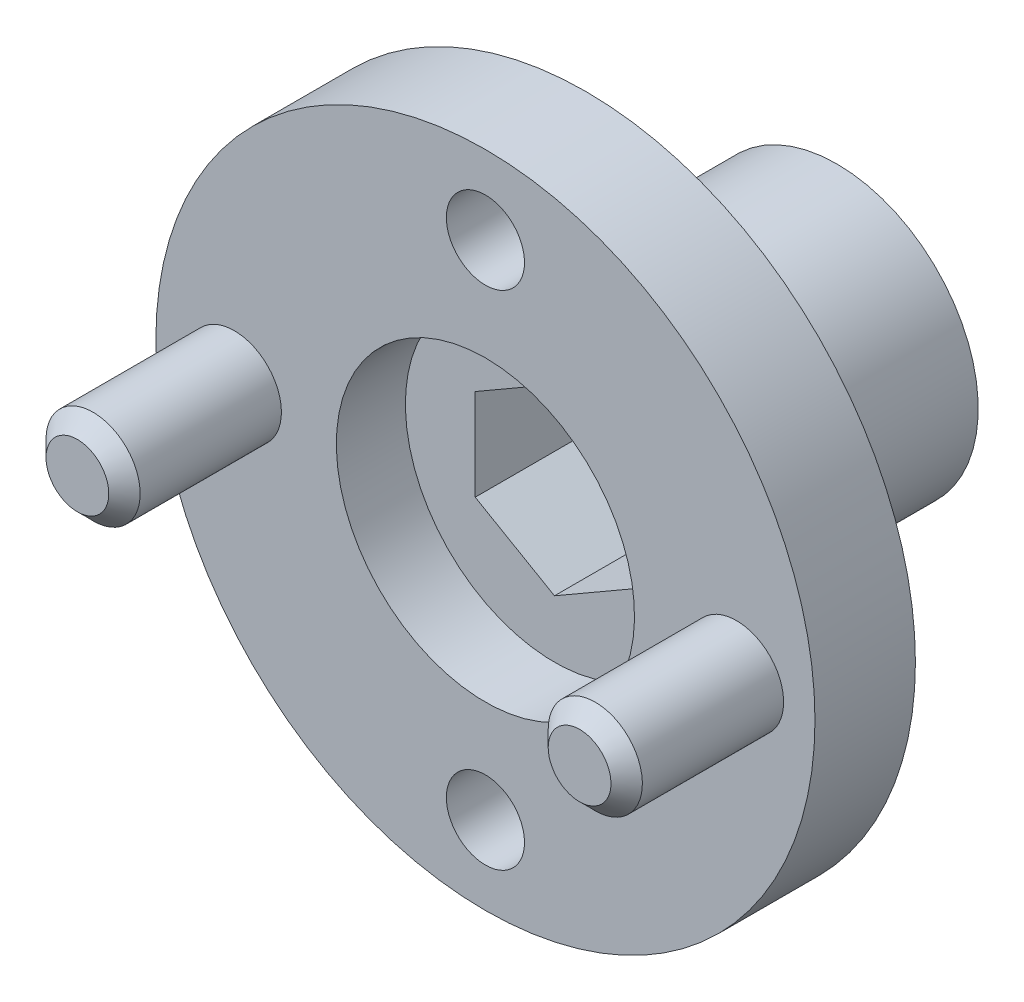
ISO-10303-21;
HEADER;
FILE_DESCRIPTION(('STEP AP214'),'2;1');
FILE_NAME('part.step','',(''),(''),'','','');
FILE_SCHEMA(('AUTOMOTIVE_DESIGN { 1 0 10303 214 1 1 1 1 }'));
ENDSEC;
DATA;
#1=APPLICATION_CONTEXT('core data for automotive mechanical design processes');
#2=APPLICATION_PROTOCOL_DEFINITION('international standard','automotive_design',2000,#1);
#3=PRODUCT_CONTEXT('',#1,'mechanical');
#4=PRODUCT('Part','Part','',(#3));
#5=PRODUCT_RELATED_PRODUCT_CATEGORY('part','',(#4));
#6=PRODUCT_DEFINITION_FORMATION('','',#4);
#7=PRODUCT_DEFINITION_CONTEXT('part definition',#1,'design');
#8=PRODUCT_DEFINITION('design','',#6,#7);
#9=PRODUCT_DEFINITION_SHAPE('','',#8);
#10=(LENGTH_UNIT() NAMED_UNIT(*) SI_UNIT(.MILLI.,.METRE.));
#11=(NAMED_UNIT(*) PLANE_ANGLE_UNIT() SI_UNIT($,.RADIAN.));
#12=(NAMED_UNIT(*) SI_UNIT($,.STERADIAN.) SOLID_ANGLE_UNIT());
#13=UNCERTAINTY_MEASURE_WITH_UNIT(LENGTH_MEASURE(1.E-05),#10,'distance_accuracy_value','');
#14=(GEOMETRIC_REPRESENTATION_CONTEXT(3) GLOBAL_UNCERTAINTY_ASSIGNED_CONTEXT((#13)) GLOBAL_UNIT_ASSIGNED_CONTEXT((#10,
#11,#12)) REPRESENTATION_CONTEXT('',''));
#15=CARTESIAN_POINT('',(0.,0.,0.));
#16=DIRECTION('',(0.,0.,1.));
#17=DIRECTION('',(1.,0.,0.));
#18=AXIS2_PLACEMENT_3D('',#15,#16,#17);
#19=CARTESIAN_POINT('',(0.,0.,-7.7));
#20=DIRECTION('',(0.,0.,-1.));
#21=DIRECTION('',(0.,1.,0.));
#22=AXIS2_PLACEMENT_3D('',#19,#20,#21);
#23=CYLINDRICAL_SURFACE('',#22,4.5);
#24=CARTESIAN_POINT('',(0.,0.,-11.2));
#25=DIRECTION('',(0.,0.,-1.));
#26=DIRECTION('',(0.,1.,0.));
#27=AXIS2_PLACEMENT_3D('',#24,#25,#26);
#28=CIRCLE('',#27,4.5);
#29=CARTESIAN_POINT('',(0.,4.5,-11.2));
#30=VERTEX_POINT('',#29);
#31=EDGE_CURVE('E20',#30,#30,#28,.T.);
#32=ORIENTED_EDGE('',*,*,#31,.F.);
#33=EDGE_LOOP('',(#32));
#34=FACE_BOUND('',#33,.T.);
#35=CARTESIAN_POINT('',(0.,0.,-4.2));
#36=DIRECTION('',(0.,0.,-1.));
#37=DIRECTION('',(0.,1.,0.));
#38=AXIS2_PLACEMENT_3D('',#35,#36,#37);
#39=CIRCLE('',#38,4.5);
#40=CARTESIAN_POINT('',(0.,4.5,-4.2));
#41=VERTEX_POINT('',#40);
#42=EDGE_CURVE('E86',#41,#41,#39,.F.);
#43=ORIENTED_EDGE('',*,*,#42,.F.);
#44=EDGE_LOOP('',(#43));
#45=FACE_BOUND('',#44,.T.);
#46=ADVANCED_FACE('F17',(#34,#45),#23,.T.);
#47=CARTESIAN_POINT('',(0.,0.,-11.2));
#48=DIRECTION('',(0.,0.,-1.));
#49=DIRECTION('',(0.,1.,0.));
#50=AXIS2_PLACEMENT_3D('',#47,#48,#49);
#51=PLANE('',#50);
#52=ORIENTED_EDGE('',*,*,#31,.T.);
#53=EDGE_LOOP('',(#52));
#54=FACE_BOUND('',#53,.T.);
#55=DIRECTION('',(0.,-1.,0.));
#56=VECTOR('',#55,1.);
#57=CARTESIAN_POINT('',(-2.525,1.45780942970381,-11.2));
#58=LINE('',#57,#56);
#59=CARTESIAN_POINT('',(-2.525,1.4578094297038,-11.2));
#60=VERTEX_POINT('',#59);
#61=CARTESIAN_POINT('',(-2.525,-1.4578094297038,-11.2));
#62=VERTEX_POINT('',#61);
#63=EDGE_CURVE('E73',#60,#62,#58,.T.);
#64=ORIENTED_EDGE('',*,*,#63,.T.);
#65=DIRECTION('',(0.866025403784439,-0.5,0.));
#66=VECTOR('',#65,1.);
#67=CARTESIAN_POINT('',(-2.525,-1.4578094297038,-11.2));
#68=LINE('',#67,#66);
#69=CARTESIAN_POINT('',(0.,-2.91561885940761,-11.2));
#70=VERTEX_POINT('',#69);
#71=EDGE_CURVE('E407',#62,#70,#68,.T.);
#72=ORIENTED_EDGE('',*,*,#71,.T.);
#73=DIRECTION('',(0.866025403784439,0.5,0.));
#74=VECTOR('',#73,1.);
#75=CARTESIAN_POINT('',(0.,-2.91561885940761,-11.2));
#76=LINE('',#75,#74);
#77=CARTESIAN_POINT('',(2.525,-1.45780942970381,-11.2));
#78=VERTEX_POINT('',#77);
#79=EDGE_CURVE('E391',#70,#78,#76,.T.);
#80=ORIENTED_EDGE('',*,*,#79,.T.);
#81=DIRECTION('',(0.,1.,0.));
#82=VECTOR('',#81,1.);
#83=CARTESIAN_POINT('',(2.525,-1.4578094297038,-11.2));
#84=LINE('',#83,#82);
#85=CARTESIAN_POINT('',(2.525,1.4578094297038,-11.2));
#86=VERTEX_POINT('',#85);
#87=EDGE_CURVE('E386',#78,#86,#84,.T.);
#88=ORIENTED_EDGE('',*,*,#87,.T.);
#89=DIRECTION('',(-0.866025403784438,0.5,0.));
#90=VECTOR('',#89,1.);
#91=CARTESIAN_POINT('',(2.525,1.4578094297038,-11.2));
#92=LINE('',#91,#90);
#93=CARTESIAN_POINT('',(0.,2.91561885940761,-11.2));
#94=VERTEX_POINT('',#93);
#95=EDGE_CURVE('E68',#86,#94,#92,.T.);
#96=ORIENTED_EDGE('',*,*,#95,.T.);
#97=DIRECTION('',(-0.866025403784439,-0.5,0.));
#98=VECTOR('',#97,1.);
#99=CARTESIAN_POINT('',(0.,2.91561885940761,-11.2));
#100=LINE('',#99,#98);
#101=EDGE_CURVE('E70',#94,#60,#100,.T.);
#102=ORIENTED_EDGE('',*,*,#101,.T.);
#103=EDGE_LOOP('',(#64,#72,#80,#88,#96,#102));
#104=FACE_BOUND('',#103,.T.);
#105=ADVANCED_FACE('F72',(#54,#104),#51,.T.);
#106=CARTESIAN_POINT('',(0.,4.5,-4.2));
#107=DIRECTION('',(0.,0.,-1.));
#108=DIRECTION('',(0.,1.,0.));
#109=AXIS2_PLACEMENT_3D('',#106,#107,#108);
#110=PLANE('',#109);
#111=CARTESIAN_POINT('',(0.,0.,-4.2));
#112=DIRECTION('',(0.,0.,-1.));
#113=DIRECTION('',(0.,1.,0.));
#114=AXIS2_PLACEMENT_3D('',#111,#112,#113);
#115=CIRCLE('',#114,6.);
#116=CARTESIAN_POINT('',(0.,6.,-4.2));
#117=VERTEX_POINT('',#116);
#118=EDGE_CURVE('E135',#117,#117,#115,.F.);
#119=ORIENTED_EDGE('',*,*,#118,.F.);
#120=EDGE_LOOP('',(#119));
#121=FACE_BOUND('',#120,.T.);
#122=ORIENTED_EDGE('',*,*,#42,.T.);
#123=EDGE_LOOP('',(#122));
#124=FACE_BOUND('',#123,.T.);
#125=ADVANCED_FACE('F150',(#121,#124),#110,.T.);
#126=CARTESIAN_POINT('',(-2.525,1.45780942970381,-11.2));
#127=DIRECTION('',(-1.,0.,0.));
#128=DIRECTION('',(0.,-1.,0.));
#129=AXIS2_PLACEMENT_3D('',#126,#127,#128);
#130=PLANE('',#129);
#131=ORIENTED_EDGE('',*,*,#63,.F.);
#132=DIRECTION('',(0.,0.,1.));
#133=VECTOR('',#132,1.);
#134=CARTESIAN_POINT('',(-2.525,1.4578094297038,-11.2));
#135=LINE('',#134,#133);
#136=CARTESIAN_POINT('',(-2.525,1.4578094297038,-2.2));
#137=VERTEX_POINT('',#136);
#138=EDGE_CURVE('E78',#60,#137,#135,.T.);
#139=ORIENTED_EDGE('',*,*,#138,.T.);
#140=DIRECTION('',(0.,-1.,0.));
#141=VECTOR('',#140,1.);
#142=CARTESIAN_POINT('',(-2.525,4.75,-2.2));
#143=LINE('',#142,#141);
#144=CARTESIAN_POINT('',(-2.525,-1.4578094297038,-2.2));
#145=VERTEX_POINT('',#144);
#146=EDGE_CURVE('E137',#145,#137,#143,.F.);
#147=ORIENTED_EDGE('',*,*,#146,.F.);
#148=DIRECTION('',(0.,0.,1.));
#149=VECTOR('',#148,1.);
#150=CARTESIAN_POINT('',(-2.525,-1.4578094297038,-11.2));
#151=LINE('',#150,#149);
#152=EDGE_CURVE('E84',#145,#62,#151,.F.);
#153=ORIENTED_EDGE('',*,*,#152,.T.);
#154=EDGE_LOOP('',(#131,#139,#147,#153));
#155=FACE_BOUND('',#154,.T.);
#156=ADVANCED_FACE('F81',(#155),#130,.F.);
#157=CARTESIAN_POINT('',(0.,2.91561885940761,-11.2));
#158=DIRECTION('',(-0.5,0.866025403784439,0.));
#159=DIRECTION('',(-0.866025403784439,-0.5,0.));
#160=AXIS2_PLACEMENT_3D('',#157,#158,#159);
#161=PLANE('',#160);
#162=ORIENTED_EDGE('',*,*,#101,.F.);
#163=DIRECTION('',(0.,0.,1.));
#164=VECTOR('',#163,1.);
#165=CARTESIAN_POINT('',(0.,2.91561885940761,-11.2));
#166=LINE('',#165,#164);
#167=CARTESIAN_POINT('',(0.,2.91561885940761,-2.2));
#168=VERTEX_POINT('',#167);
#169=EDGE_CURVE('E93',#94,#168,#166,.T.);
#170=ORIENTED_EDGE('',*,*,#169,.T.);
#171=DIRECTION('',(0.866025403784439,0.5,0.));
#172=VECTOR('',#171,1.);
#173=CARTESIAN_POINT('',(-2.525,1.4578094297038,-2.2));
#174=LINE('',#173,#172);
#175=EDGE_CURVE('E90',#137,#168,#174,.T.);
#176=ORIENTED_EDGE('',*,*,#175,.F.);
#177=ORIENTED_EDGE('',*,*,#138,.F.);
#178=EDGE_LOOP('',(#162,#170,#176,#177));
#179=FACE_BOUND('',#178,.T.);
#180=ADVANCED_FACE('F88',(#179),#161,.F.);
#181=CARTESIAN_POINT('',(2.525,1.4578094297038,-11.2));
#182=DIRECTION('',(0.5,0.866025403784438,0.));
#183=DIRECTION('',(-0.866025403784438,0.5,0.));
#184=AXIS2_PLACEMENT_3D('',#181,#182,#183);
#185=PLANE('',#184);
#186=ORIENTED_EDGE('',*,*,#95,.F.);
#187=DIRECTION('',(0.,0.,1.));
#188=VECTOR('',#187,1.);
#189=CARTESIAN_POINT('',(2.525,1.4578094297038,-11.2));
#190=LINE('',#189,#188);
#191=CARTESIAN_POINT('',(2.525,1.4578094297038,-2.2));
#192=VERTEX_POINT('',#191);
#193=EDGE_CURVE('E383',#86,#192,#190,.T.);
#194=ORIENTED_EDGE('',*,*,#193,.T.);
#195=DIRECTION('',(0.866025403784438,-0.500000000000001,0.));
#196=VECTOR('',#195,1.);
#197=CARTESIAN_POINT('',(0.,2.91561885940761,-2.2));
#198=LINE('',#197,#196);
#199=EDGE_CURVE('E397',#168,#192,#198,.T.);
#200=ORIENTED_EDGE('',*,*,#199,.F.);
#201=ORIENTED_EDGE('',*,*,#169,.F.);
#202=EDGE_LOOP('',(#186,#194,#200,#201));
#203=FACE_BOUND('',#202,.T.);
#204=ADVANCED_FACE('F221',(#203),#185,.F.);
#205=CARTESIAN_POINT('',(2.525,-1.4578094297038,-11.2));
#206=DIRECTION('',(1.,0.,0.));
#207=DIRECTION('',(0.,1.,0.));
#208=AXIS2_PLACEMENT_3D('',#205,#206,#207);
#209=PLANE('',#208);
#210=ORIENTED_EDGE('',*,*,#87,.F.);
#211=DIRECTION('',(0.,0.,1.));
#212=VECTOR('',#211,1.);
#213=CARTESIAN_POINT('',(2.525,-1.45780942970381,-11.2));
#214=LINE('',#213,#212);
#215=CARTESIAN_POINT('',(2.525,-1.45780942970381,-2.2));
#216=VERTEX_POINT('',#215);
#217=EDGE_CURVE('E393',#78,#216,#214,.T.);
#218=ORIENTED_EDGE('',*,*,#217,.T.);
#219=DIRECTION('',(0.,-1.,0.));
#220=VECTOR('',#219,1.);
#221=CARTESIAN_POINT('',(2.525,4.75,-2.2));
#222=LINE('',#221,#220);
#223=EDGE_CURVE('E389',#192,#216,#222,.T.);
#224=ORIENTED_EDGE('',*,*,#223,.F.);
#225=ORIENTED_EDGE('',*,*,#193,.F.);
#226=EDGE_LOOP('',(#210,#218,#224,#225));
#227=FACE_BOUND('',#226,.T.);
#228=ADVANCED_FACE('F218',(#227),#209,.F.);
#229=CARTESIAN_POINT('',(0.,-2.91561885940761,-11.2));
#230=DIRECTION('',(0.5,-0.866025403784439,0.));
#231=DIRECTION('',(0.866025403784439,0.5,0.));
#232=AXIS2_PLACEMENT_3D('',#229,#230,#231);
#233=PLANE('',#232);
#234=ORIENTED_EDGE('',*,*,#79,.F.);
#235=DIRECTION('',(0.,0.,1.));
#236=VECTOR('',#235,1.);
#237=CARTESIAN_POINT('',(0.,-2.91561885940761,-11.2));
#238=LINE('',#237,#236);
#239=CARTESIAN_POINT('',(0.,-2.91561885940761,-2.2));
#240=VERTEX_POINT('',#239);
#241=EDGE_CURVE('E35',#70,#240,#238,.T.);
#242=ORIENTED_EDGE('',*,*,#241,.T.);
#243=DIRECTION('',(-0.866025403784439,-0.499999999999999,0.));
#244=VECTOR('',#243,1.);
#245=CARTESIAN_POINT('',(2.525,-1.45780942970381,-2.2));
#246=LINE('',#245,#244);
#247=EDGE_CURVE('E409',#216,#240,#246,.T.);
#248=ORIENTED_EDGE('',*,*,#247,.F.);
#249=ORIENTED_EDGE('',*,*,#217,.F.);
#250=EDGE_LOOP('',(#234,#242,#248,#249));
#251=FACE_BOUND('',#250,.T.);
#252=ADVANCED_FACE('F214',(#251),#233,.F.);
#253=CARTESIAN_POINT('',(-2.525,-1.4578094297038,-11.2));
#254=DIRECTION('',(-0.5,-0.866025403784439,0.));
#255=DIRECTION('',(0.866025403784439,-0.5,0.));
#256=AXIS2_PLACEMENT_3D('',#253,#254,#255);
#257=PLANE('',#256);
#258=ORIENTED_EDGE('',*,*,#71,.F.);
#259=ORIENTED_EDGE('',*,*,#152,.F.);
#260=DIRECTION('',(-0.866025403784438,0.5,0.));
#261=VECTOR('',#260,1.);
#262=CARTESIAN_POINT('',(0.,-2.91561885940761,-2.2));
#263=LINE('',#262,#261);
#264=EDGE_CURVE('E134',#240,#145,#263,.T.);
#265=ORIENTED_EDGE('',*,*,#264,.F.);
#266=ORIENTED_EDGE('',*,*,#241,.F.);
#267=EDGE_LOOP('',(#258,#259,#265,#266));
#268=FACE_BOUND('',#267,.T.);
#269=ADVANCED_FACE('F210',(#268),#257,.F.);
#270=CARTESIAN_POINT('',(8.,0.,5.));
#271=DIRECTION('',(0.,0.,-1.));
#272=DIRECTION('',(0.,1.,0.));
#273=AXIS2_PLACEMENT_3D('',#270,#271,#272);
#274=PLANE('',#273);
#275=CARTESIAN_POINT('',(8.,0.,4.99999999999545));
#276=DIRECTION('',(0.,0.,-1.));
#277=DIRECTION('',(-1.,0.,0.));
#278=AXIS2_PLACEMENT_3D('',#275,#276,#277);
#279=CIRCLE('',#278,0.999999999881311);
#280=CARTESIAN_POINT('',(7.00000000011869,0.,4.99999999999545));
#281=VERTEX_POINT('',#280);
#282=EDGE_CURVE('E131',#281,#281,#279,.T.);
#283=ORIENTED_EDGE('',*,*,#282,.F.);
#284=EDGE_LOOP('',(#283));
#285=FACE_BOUND('',#284,.T.);
#286=ADVANCED_FACE('F206',(#285),#274,.F.);
#287=CARTESIAN_POINT('',(-8.,0.,5.));
#288=DIRECTION('',(0.,0.,-1.));
#289=DIRECTION('',(0.,1.,0.));
#290=AXIS2_PLACEMENT_3D('',#287,#288,#289);
#291=PLANE('',#290);
#292=CARTESIAN_POINT('',(-8.,0.,4.99999999999545));
#293=DIRECTION('',(0.,0.,-1.));
#294=DIRECTION('',(-1.,0.,0.));
#295=AXIS2_PLACEMENT_3D('',#292,#293,#294);
#296=CIRCLE('',#295,1.00000000001455);
#297=CARTESIAN_POINT('',(-9.00000000001455,0.,4.99999999999545));
#298=VERTEX_POINT('',#297);
#299=EDGE_CURVE('E128',#298,#298,#296,.T.);
#300=ORIENTED_EDGE('',*,*,#299,.F.);
#301=EDGE_LOOP('',(#300));
#302=FACE_BOUND('',#301,.T.);
#303=ADVANCED_FACE('F202',(#302),#291,.F.);
#304=CARTESIAN_POINT('',(0.,0.,-3.7));
#305=DIRECTION('',(0.,0.,-1.));
#306=DIRECTION('',(0.,1.,0.));
#307=AXIS2_PLACEMENT_3D('',#304,#305,#306);
#308=CYLINDRICAL_SURFACE('',#307,6.);
#309=ORIENTED_EDGE('',*,*,#118,.T.);
#310=EDGE_LOOP('',(#309));
#311=FACE_BOUND('',#310,.T.);
#312=CARTESIAN_POINT('',(0.,0.,-3.2));
#313=DIRECTION('',(0.,0.,-1.));
#314=DIRECTION('',(0.,1.,0.));
#315=AXIS2_PLACEMENT_3D('',#312,#313,#314);
#316=CIRCLE('',#315,6.);
#317=CARTESIAN_POINT('',(0.,6.,-3.2));
#318=VERTEX_POINT('',#317);
#319=EDGE_CURVE('E125',#318,#318,#316,.F.);
#320=ORIENTED_EDGE('',*,*,#319,.F.);
#321=EDGE_LOOP('',(#320));
#322=FACE_BOUND('',#321,.T.);
#323=ADVANCED_FACE('F198',(#311,#322),#308,.T.);
#324=CARTESIAN_POINT('',(0.,4.75,-2.2));
#325=DIRECTION('',(0.,0.,1.));
#326=DIRECTION('',(0.,-1.,0.));
#327=AXIS2_PLACEMENT_3D('',#324,#325,#326);
#328=PLANE('',#327);
#329=CARTESIAN_POINT('',(0.,0.,-2.2));
#330=DIRECTION('',(0.,0.,-1.));
#331=DIRECTION('',(0.,1.,0.));
#332=AXIS2_PLACEMENT_3D('',#329,#330,#331);
#333=CIRCLE('',#332,4.75);
#334=CARTESIAN_POINT('',(0.,4.75,-2.2));
#335=VERTEX_POINT('',#334);
#336=EDGE_CURVE('E121',#335,#335,#333,.F.);
#337=ORIENTED_EDGE('',*,*,#336,.T.);
#338=EDGE_LOOP('',(#337));
#339=FACE_BOUND('',#338,.T.);
#340=ORIENTED_EDGE('',*,*,#247,.T.);
#341=ORIENTED_EDGE('',*,*,#264,.T.);
#342=ORIENTED_EDGE('',*,*,#146,.T.);
#343=ORIENTED_EDGE('',*,*,#175,.T.);
#344=ORIENTED_EDGE('',*,*,#199,.T.);
#345=ORIENTED_EDGE('',*,*,#223,.T.);
#346=EDGE_LOOP('',(#340,#341,#342,#343,#344,#345));
#347=FACE_BOUND('',#346,.T.);
#348=ADVANCED_FACE('F194',(#339,#347),#328,.T.);
#349=CARTESIAN_POINT('',(8.,0.,4.50000000000728));
#350=DIRECTION('',(0.,0.,-1.));
#351=DIRECTION('',(-1.,0.,0.));
#352=AXIS2_PLACEMENT_3D('',#349,#350,#351);
#353=CONICAL_SURFACE('',#352,1.49999999992633,0.785398163454292);
#354=ORIENTED_EDGE('',*,*,#282,.T.);
#355=EDGE_LOOP('',(#354));
#356=FACE_BOUND('',#355,.T.);
#357=CARTESIAN_POINT('',(8.,0.,4.5));
#358=DIRECTION('',(0.,0.,1.));
#359=DIRECTION('',(0.,-1.,0.));
#360=AXIS2_PLACEMENT_3D('',#357,#358,#359);
#361=CIRCLE('',#360,1.5);
#362=CARTESIAN_POINT('',(8.,-1.50000000000001,4.5));
#363=VERTEX_POINT('',#362);
#364=EDGE_CURVE('E124',#363,#363,#361,.F.);
#365=ORIENTED_EDGE('',*,*,#364,.F.);
#366=EDGE_LOOP('',(#365));
#367=FACE_BOUND('',#366,.T.);
#368=ADVANCED_FACE('F190',(#356,#367),#353,.T.);
#369=CARTESIAN_POINT('',(-8.,0.,4.50000000006412));
#370=DIRECTION('',(0.,0.,-1.));
#371=DIRECTION('',(-1.,0.,0.));
#372=AXIS2_PLACEMENT_3D('',#369,#370,#371);
#373=CONICAL_SURFACE('',#372,1.49999999994588,0.785398163397448);
#374=ORIENTED_EDGE('',*,*,#299,.T.);
#375=EDGE_LOOP('',(#374));
#376=FACE_BOUND('',#375,.T.);
#377=CARTESIAN_POINT('',(-8.,0.,4.5));
#378=DIRECTION('',(0.,0.,1.));
#379=DIRECTION('',(0.,-1.,0.));
#380=AXIS2_PLACEMENT_3D('',#377,#378,#379);
#381=CIRCLE('',#380,1.5);
#382=CARTESIAN_POINT('',(-8.,-1.5,4.5));
#383=VERTEX_POINT('',#382);
#384=EDGE_CURVE('E120',#383,#383,#381,.F.);
#385=ORIENTED_EDGE('',*,*,#384,.F.);
#386=EDGE_LOOP('',(#385));
#387=FACE_BOUND('',#386,.T.);
#388=ADVANCED_FACE('F186',(#376,#387),#373,.T.);
#389=CARTESIAN_POINT('',(0.,6.,-3.2));
#390=DIRECTION('',(0.,0.,-1.));
#391=DIRECTION('',(0.,1.,0.));
#392=AXIS2_PLACEMENT_3D('',#389,#390,#391);
#393=PLANE('',#392);
#394=CARTESIAN_POINT('',(0.,0.,-3.2));
#395=DIRECTION('',(0.,0.,-1.));
#396=DIRECTION('',(0.,1.,0.));
#397=AXIS2_PLACEMENT_3D('',#394,#395,#396);
#398=CIRCLE('',#397,10.5);
#399=CARTESIAN_POINT('',(0.,10.5,-3.2));
#400=VERTEX_POINT('',#399);
#401=EDGE_CURVE('E111',#400,#400,#398,.F.);
#402=ORIENTED_EDGE('',*,*,#401,.F.);
#403=EDGE_LOOP('',(#402));
#404=FACE_BOUND('',#403,.T.);
#405=CARTESIAN_POINT('',(0.,8.00000000000001,-3.2));
#406=DIRECTION('',(0.,0.,1.));
#407=DIRECTION('',(0.,-1.,0.));
#408=AXIS2_PLACEMENT_3D('',#405,#406,#407);
#409=CIRCLE('',#408,1.245);
#410=CARTESIAN_POINT('',(0.,6.75500000000001,-3.2));
#411=VERTEX_POINT('',#410);
#412=EDGE_CURVE('E114',#411,#411,#409,.T.);
#413=ORIENTED_EDGE('',*,*,#412,.T.);
#414=EDGE_LOOP('',(#413));
#415=FACE_BOUND('',#414,.T.);
#416=CARTESIAN_POINT('',(0.,-8.,-3.2));
#417=DIRECTION('',(0.,0.,1.));
#418=DIRECTION('',(0.,-1.,0.));
#419=AXIS2_PLACEMENT_3D('',#416,#417,#418);
#420=CIRCLE('',#419,1.245);
#421=CARTESIAN_POINT('',(0.,-9.245,-3.2));
#422=VERTEX_POINT('',#421);
#423=EDGE_CURVE('E117',#422,#422,#420,.T.);
#424=ORIENTED_EDGE('',*,*,#423,.T.);
#425=EDGE_LOOP('',(#424));
#426=FACE_BOUND('',#425,.T.);
#427=ORIENTED_EDGE('',*,*,#319,.T.);
#428=EDGE_LOOP('',(#427));
#429=FACE_BOUND('',#428,.T.);
#430=ADVANCED_FACE('F182',(#404,#415,#426,#429),#393,.T.);
#431=CARTESIAN_POINT('',(0.,0.,-1.1));
#432=DIRECTION('',(0.,0.,-1.));
#433=DIRECTION('',(0.,1.,0.));
#434=AXIS2_PLACEMENT_3D('',#431,#432,#433);
#435=CYLINDRICAL_SURFACE('',#434,4.75);
#436=ORIENTED_EDGE('',*,*,#336,.F.);
#437=EDGE_LOOP('',(#436));
#438=FACE_BOUND('',#437,.T.);
#439=CARTESIAN_POINT('',(0.,0.,0.));
#440=DIRECTION('',(0.,0.,-1.));
#441=DIRECTION('',(0.,1.,0.));
#442=AXIS2_PLACEMENT_3D('',#439,#440,#441);
#443=CIRCLE('',#442,4.75);
#444=CARTESIAN_POINT('',(0.,4.75,0.));
#445=VERTEX_POINT('',#444);
#446=EDGE_CURVE('E108',#445,#445,#443,.T.);
#447=ORIENTED_EDGE('',*,*,#446,.F.);
#448=EDGE_LOOP('',(#447));
#449=FACE_BOUND('',#448,.T.);
#450=ADVANCED_FACE('F178',(#438,#449),#435,.F.);
#451=CARTESIAN_POINT('',(8.,0.,0.));
#452=DIRECTION('',(0.,0.,1.));
#453=DIRECTION('',(0.,-1.,0.));
#454=AXIS2_PLACEMENT_3D('',#451,#452,#453);
#455=CYLINDRICAL_SURFACE('',#454,1.5);
#456=ORIENTED_EDGE('',*,*,#364,.T.);
#457=EDGE_LOOP('',(#456));
#458=FACE_BOUND('',#457,.T.);
#459=CARTESIAN_POINT('',(8.,0.,0.));
#460=DIRECTION('',(0.,0.,1.));
#461=DIRECTION('',(0.,-1.,0.));
#462=AXIS2_PLACEMENT_3D('',#459,#460,#461);
#463=CIRCLE('',#462,1.5);
#464=CARTESIAN_POINT('',(8.,-1.50000000000001,0.));
#465=VERTEX_POINT('',#464);
#466=EDGE_CURVE('E105',#465,#465,#463,.F.);
#467=ORIENTED_EDGE('',*,*,#466,.F.);
#468=EDGE_LOOP('',(#467));
#469=FACE_BOUND('',#468,.T.);
#470=ADVANCED_FACE('F174',(#458,#469),#455,.T.);
#471=CARTESIAN_POINT('',(-8.,0.,0.));
#472=DIRECTION('',(0.,0.,1.));
#473=DIRECTION('',(0.,-1.,0.));
#474=AXIS2_PLACEMENT_3D('',#471,#472,#473);
#475=CYLINDRICAL_SURFACE('',#474,1.5);
#476=ORIENTED_EDGE('',*,*,#384,.T.);
#477=EDGE_LOOP('',(#476));
#478=FACE_BOUND('',#477,.T.);
#479=CARTESIAN_POINT('',(-8.,0.,0.));
#480=DIRECTION('',(0.,0.,1.));
#481=DIRECTION('',(0.,-1.,0.));
#482=AXIS2_PLACEMENT_3D('',#479,#480,#481);
#483=CIRCLE('',#482,1.5);
#484=CARTESIAN_POINT('',(-8.,-1.5,0.));
#485=VERTEX_POINT('',#484);
#486=EDGE_CURVE('E102',#485,#485,#483,.F.);
#487=ORIENTED_EDGE('',*,*,#486,.F.);
#488=EDGE_LOOP('',(#487));
#489=FACE_BOUND('',#488,.T.);
#490=ADVANCED_FACE('F170',(#478,#489),#475,.T.);
#491=CARTESIAN_POINT('',(0.,-8.,-33.8295728616251));
#492=DIRECTION('',(0.,0.,1.));
#493=DIRECTION('',(0.,-1.,0.));
#494=AXIS2_PLACEMENT_3D('',#491,#492,#493);
#495=CYLINDRICAL_SURFACE('',#494,1.245);
#496=ORIENTED_EDGE('',*,*,#423,.F.);
#497=EDGE_LOOP('',(#496));
#498=FACE_BOUND('',#497,.T.);
#499=CARTESIAN_POINT('',(0.,-8.,0.));
#500=DIRECTION('',(0.,0.,1.));
#501=DIRECTION('',(0.,-1.,0.));
#502=AXIS2_PLACEMENT_3D('',#499,#500,#501);
#503=CIRCLE('',#502,1.245);
#504=CARTESIAN_POINT('',(0.,-9.245,0.));
#505=VERTEX_POINT('',#504);
#506=EDGE_CURVE('E99',#505,#505,#503,.F.);
#507=ORIENTED_EDGE('',*,*,#506,.F.);
#508=EDGE_LOOP('',(#507));
#509=FACE_BOUND('',#508,.T.);
#510=ADVANCED_FACE('F166',(#498,#509),#495,.F.);
#511=CARTESIAN_POINT('',(0.,8.00000000000001,-33.8295728616251));
#512=DIRECTION('',(0.,0.,1.));
#513=DIRECTION('',(0.,-1.,0.));
#514=AXIS2_PLACEMENT_3D('',#511,#512,#513);
#515=CYLINDRICAL_SURFACE('',#514,1.245);
#516=ORIENTED_EDGE('',*,*,#412,.F.);
#517=EDGE_LOOP('',(#516));
#518=FACE_BOUND('',#517,.T.);
#519=CARTESIAN_POINT('',(0.,8.00000000000001,0.));
#520=DIRECTION('',(0.,0.,1.));
#521=DIRECTION('',(0.,-1.,0.));
#522=AXIS2_PLACEMENT_3D('',#519,#520,#521);
#523=CIRCLE('',#522,1.245);
#524=CARTESIAN_POINT('',(0.,6.75500000000001,0.));
#525=VERTEX_POINT('',#524);
#526=EDGE_CURVE('E26',#525,#525,#523,.F.);
#527=ORIENTED_EDGE('',*,*,#526,.F.);
#528=EDGE_LOOP('',(#527));
#529=FACE_BOUND('',#528,.T.);
#530=ADVANCED_FACE('F159',(#518,#529),#515,.F.);
#531=CARTESIAN_POINT('',(0.,0.,-1.6));
#532=DIRECTION('',(0.,0.,-1.));
#533=DIRECTION('',(0.,1.,0.));
#534=AXIS2_PLACEMENT_3D('',#531,#532,#533);
#535=CYLINDRICAL_SURFACE('',#534,10.5);
#536=ORIENTED_EDGE('',*,*,#401,.T.);
#537=EDGE_LOOP('',(#536));
#538=FACE_BOUND('',#537,.T.);
#539=CARTESIAN_POINT('',(0.,0.,0.));
#540=DIRECTION('',(0.,0.,-1.));
#541=DIRECTION('',(0.,1.,0.));
#542=AXIS2_PLACEMENT_3D('',#539,#540,#541);
#543=CIRCLE('',#542,10.5);
#544=CARTESIAN_POINT('',(0.,10.5,0.));
#545=VERTEX_POINT('',#544);
#546=EDGE_CURVE('E10',#545,#545,#543,.F.);
#547=ORIENTED_EDGE('',*,*,#546,.F.);
#548=EDGE_LOOP('',(#547));
#549=FACE_BOUND('',#548,.T.);
#550=ADVANCED_FACE('F153',(#538,#549),#535,.T.);
#551=CARTESIAN_POINT('',(0.,10.5,0.));
#552=DIRECTION('',(0.,0.,1.));
#553=DIRECTION('',(0.,-1.,0.));
#554=AXIS2_PLACEMENT_3D('',#551,#552,#553);
#555=PLANE('',#554);
#556=ORIENTED_EDGE('',*,*,#546,.T.);
#557=EDGE_LOOP('',(#556));
#558=FACE_BOUND('',#557,.T.);
#559=ORIENTED_EDGE('',*,*,#526,.T.);
#560=EDGE_LOOP('',(#559));
#561=FACE_BOUND('',#560,.T.);
#562=ORIENTED_EDGE('',*,*,#506,.T.);
#563=EDGE_LOOP('',(#562));
#564=FACE_BOUND('',#563,.T.);
#565=ORIENTED_EDGE('',*,*,#486,.T.);
#566=EDGE_LOOP('',(#565));
#567=FACE_BOUND('',#566,.T.);
#568=ORIENTED_EDGE('',*,*,#466,.T.);
#569=EDGE_LOOP('',(#568));
#570=FACE_BOUND('',#569,.T.);
#571=ORIENTED_EDGE('',*,*,#446,.T.);
#572=EDGE_LOOP('',(#571));
#573=FACE_BOUND('',#572,.T.);
#574=ADVANCED_FACE('F151',(#558,#561,#564,#567,#570,#573),#555,.T.);
#575=CLOSED_SHELL('',(#46,#105,#125,#156,#180,#204,#228,#252,#269,#286,#303,#323,#348,#368,#388,
#430,#450,#470,#490,#510,#530,#550,#574));
#576=MANIFOLD_SOLID_BREP('B1',#575);
#577=ADVANCED_BREP_SHAPE_REPRESENTATION('',(#18,#576),#14);
#578=SHAPE_DEFINITION_REPRESENTATION(#9,#577);
ENDSEC;
END-ISO-10303-21;
